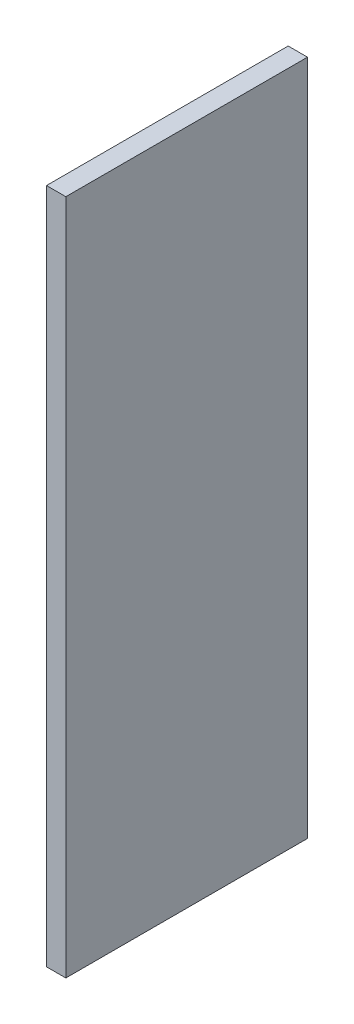
ISO-10303-21;
HEADER;
FILE_DESCRIPTION(('STEP AP214'),'2;1');
FILE_NAME('part.step','',(''),(''),'','','');
FILE_SCHEMA(('AUTOMOTIVE_DESIGN { 1 0 10303 214 1 1 1 1 }'));
ENDSEC;
DATA;
#1=APPLICATION_CONTEXT('core data for automotive mechanical design processes');
#2=APPLICATION_PROTOCOL_DEFINITION('international standard','automotive_design',2000,#1);
#3=PRODUCT_CONTEXT('',#1,'mechanical');
#4=PRODUCT('Part','Part','',(#3));
#5=PRODUCT_RELATED_PRODUCT_CATEGORY('part','',(#4));
#6=PRODUCT_DEFINITION_FORMATION('','',#4);
#7=PRODUCT_DEFINITION_CONTEXT('part definition',#1,'design');
#8=PRODUCT_DEFINITION('design','',#6,#7);
#9=PRODUCT_DEFINITION_SHAPE('','',#8);
#10=(LENGTH_UNIT() NAMED_UNIT(*) SI_UNIT(.MILLI.,.METRE.));
#11=(NAMED_UNIT(*) PLANE_ANGLE_UNIT() SI_UNIT($,.RADIAN.));
#12=(NAMED_UNIT(*) SI_UNIT($,.STERADIAN.) SOLID_ANGLE_UNIT());
#13=UNCERTAINTY_MEASURE_WITH_UNIT(LENGTH_MEASURE(1.E-05),#10,'distance_accuracy_value','');
#14=(GEOMETRIC_REPRESENTATION_CONTEXT(3) GLOBAL_UNCERTAINTY_ASSIGNED_CONTEXT((#13)) GLOBAL_UNIT_ASSIGNED_CONTEXT((#10,
#11,#12)) REPRESENTATION_CONTEXT('',''));
#15=CARTESIAN_POINT('',(0.,0.,0.));
#16=DIRECTION('',(0.,0.,1.));
#17=DIRECTION('',(1.,0.,0.));
#18=AXIS2_PLACEMENT_3D('',#15,#16,#17);
#19=CARTESIAN_POINT('',(0.,0.,5.));
#20=DIRECTION('',(1.,0.,0.));
#21=DIRECTION('',(0.,1.,0.));
#22=AXIS2_PLACEMENT_3D('',#19,#20,#21);
#23=PLANE('',#22);
#24=DIRECTION('',(0.,-1.,0.));
#25=VECTOR('',#24,1.);
#26=CARTESIAN_POINT('',(0.,0.,0.));
#27=LINE('',#26,#25);
#28=CARTESIAN_POINT('',(0.,14.,0.));
#29=VERTEX_POINT('',#28);
#30=CARTESIAN_POINT('',(0.,0.,0.));
#31=VERTEX_POINT('',#30);
#32=EDGE_CURVE('E96',#29,#31,#27,.T.);
#33=ORIENTED_EDGE('',*,*,#32,.T.);
#34=DIRECTION('',(0.,0.,-1.));
#35=VECTOR('',#34,1.);
#36=CARTESIAN_POINT('',(0.,0.,5.));
#37=LINE('',#36,#35);
#38=CARTESIAN_POINT('',(0.,0.,5.));
#39=VERTEX_POINT('',#38);
#40=EDGE_CURVE('E11',#39,#31,#37,.T.);
#41=ORIENTED_EDGE('',*,*,#40,.F.);
#42=DIRECTION('',(0.,-1.,0.));
#43=VECTOR('',#42,1.);
#44=CARTESIAN_POINT('',(0.,0.,5.));
#45=LINE('',#44,#43);
#46=CARTESIAN_POINT('',(0.,14.,5.));
#47=VERTEX_POINT('',#46);
#48=EDGE_CURVE('E84',#47,#39,#45,.T.);
#49=ORIENTED_EDGE('',*,*,#48,.F.);
#50=DIRECTION('',(0.,0.,-1.));
#51=VECTOR('',#50,1.);
#52=CARTESIAN_POINT('',(0.,14.,5.));
#53=LINE('',#52,#51);
#54=EDGE_CURVE('E92',#47,#29,#53,.T.);
#55=ORIENTED_EDGE('',*,*,#54,.T.);
#56=EDGE_LOOP('',(#33,#41,#49,#55));
#57=FACE_BOUND('',#56,.T.);
#58=ADVANCED_FACE('F33',(#57),#23,.F.);
#59=CARTESIAN_POINT('',(0.,0.,5.));
#60=DIRECTION('',(0.,1.,0.));
#61=DIRECTION('',(0.,0.,1.));
#62=AXIS2_PLACEMENT_3D('',#59,#60,#61);
#63=PLANE('',#62);
#64=DIRECTION('',(1.,0.,0.));
#65=VECTOR('',#64,1.);
#66=CARTESIAN_POINT('',(0.,0.,0.));
#67=LINE('',#66,#65);
#68=CARTESIAN_POINT('',(0.4,0.,0.));
#69=VERTEX_POINT('',#68);
#70=EDGE_CURVE('E88',#31,#69,#67,.T.);
#71=ORIENTED_EDGE('',*,*,#70,.T.);
#72=DIRECTION('',(0.,0.,-1.));
#73=VECTOR('',#72,1.);
#74=CARTESIAN_POINT('',(0.4,0.,5.));
#75=LINE('',#74,#73);
#76=CARTESIAN_POINT('',(0.4,0.,5.));
#77=VERTEX_POINT('',#76);
#78=EDGE_CURVE('E41',#77,#69,#75,.T.);
#79=ORIENTED_EDGE('',*,*,#78,.F.);
#80=DIRECTION('',(1.,0.,0.));
#81=VECTOR('',#80,1.);
#82=CARTESIAN_POINT('',(0.,0.,5.));
#83=LINE('',#82,#81);
#84=EDGE_CURVE('E79',#39,#77,#83,.T.);
#85=ORIENTED_EDGE('',*,*,#84,.F.);
#86=ORIENTED_EDGE('',*,*,#40,.T.);
#87=EDGE_LOOP('',(#71,#79,#85,#86));
#88=FACE_BOUND('',#87,.T.);
#89=ADVANCED_FACE('F87',(#88),#63,.F.);
#90=CARTESIAN_POINT('',(0.4,0.,5.));
#91=DIRECTION('',(-1.,0.,0.));
#92=DIRECTION('',(0.,-1.,0.));
#93=AXIS2_PLACEMENT_3D('',#90,#91,#92);
#94=PLANE('',#93);
#95=DIRECTION('',(0.,1.,0.));
#96=VECTOR('',#95,1.);
#97=CARTESIAN_POINT('',(0.4,0.,0.));
#98=LINE('',#97,#96);
#99=CARTESIAN_POINT('',(0.399999999999998,14.,0.));
#100=VERTEX_POINT('',#99);
#101=EDGE_CURVE('E66',#69,#100,#98,.T.);
#102=ORIENTED_EDGE('',*,*,#101,.T.);
#103=DIRECTION('',(0.,0.,-1.));
#104=VECTOR('',#103,1.);
#105=CARTESIAN_POINT('',(0.399999999999998,14.,5.));
#106=LINE('',#105,#104);
#107=CARTESIAN_POINT('',(0.399999999999998,14.,5.));
#108=VERTEX_POINT('',#107);
#109=EDGE_CURVE('E89',#108,#100,#106,.T.);
#110=ORIENTED_EDGE('',*,*,#109,.F.);
#111=DIRECTION('',(0.,1.,0.));
#112=VECTOR('',#111,1.);
#113=CARTESIAN_POINT('',(0.4,0.,5.));
#114=LINE('',#113,#112);
#115=EDGE_CURVE('E82',#77,#108,#114,.T.);
#116=ORIENTED_EDGE('',*,*,#115,.F.);
#117=ORIENTED_EDGE('',*,*,#78,.T.);
#118=EDGE_LOOP('',(#102,#110,#116,#117));
#119=FACE_BOUND('',#118,.T.);
#120=ADVANCED_FACE('F90',(#119),#94,.F.);
#121=CARTESIAN_POINT('',(0.,14.,5.));
#122=DIRECTION('',(0.,-1.,0.));
#123=DIRECTION('',(0.,0.,-1.));
#124=AXIS2_PLACEMENT_3D('',#121,#122,#123);
#125=PLANE('',#124);
#126=DIRECTION('',(-1.,0.,0.));
#127=VECTOR('',#126,1.);
#128=CARTESIAN_POINT('',(0.,14.,0.));
#129=LINE('',#128,#127);
#130=EDGE_CURVE('E72',#100,#29,#129,.T.);
#131=ORIENTED_EDGE('',*,*,#130,.T.);
#132=ORIENTED_EDGE('',*,*,#54,.F.);
#133=DIRECTION('',(-1.,0.,0.));
#134=VECTOR('',#133,1.);
#135=CARTESIAN_POINT('',(0.,14.,5.));
#136=LINE('',#135,#134);
#137=EDGE_CURVE('E49',#108,#47,#136,.T.);
#138=ORIENTED_EDGE('',*,*,#137,.F.);
#139=ORIENTED_EDGE('',*,*,#109,.T.);
#140=EDGE_LOOP('',(#131,#132,#138,#139));
#141=FACE_BOUND('',#140,.T.);
#142=ADVANCED_FACE('F103',(#141),#125,.F.);
#143=CARTESIAN_POINT('',(0.,0.,5.));
#144=DIRECTION('',(0.,0.,-1.));
#145=DIRECTION('',(-1.,0.,0.));
#146=AXIS2_PLACEMENT_3D('',#143,#144,#145);
#147=PLANE('',#146);
#148=ORIENTED_EDGE('',*,*,#48,.T.);
#149=ORIENTED_EDGE('',*,*,#84,.T.);
#150=ORIENTED_EDGE('',*,*,#115,.T.);
#151=ORIENTED_EDGE('',*,*,#137,.T.);
#152=EDGE_LOOP('',(#148,#149,#150,#151));
#153=FACE_BOUND('',#152,.T.);
#154=ADVANCED_FACE('F80',(#153),#147,.F.);
#155=CARTESIAN_POINT('',(0.,0.,0.));
#156=DIRECTION('',(0.,0.,-1.));
#157=DIRECTION('',(-1.,0.,0.));
#158=AXIS2_PLACEMENT_3D('',#155,#156,#157);
#159=PLANE('',#158);
#160=ORIENTED_EDGE('',*,*,#32,.F.);
#161=ORIENTED_EDGE('',*,*,#130,.F.);
#162=ORIENTED_EDGE('',*,*,#101,.F.);
#163=ORIENTED_EDGE('',*,*,#70,.F.);
#164=EDGE_LOOP('',(#160,#161,#162,#163));
#165=FACE_BOUND('',#164,.T.);
#166=ADVANCED_FACE('F106',(#165),#159,.T.);
#167=CLOSED_SHELL('',(#58,#89,#120,#142,#154,#166));
#168=MANIFOLD_SOLID_BREP('B2',#167);
#169=ADVANCED_BREP_SHAPE_REPRESENTATION('',(#18,#168),#14);
#170=SHAPE_DEFINITION_REPRESENTATION(#9,#169);
ENDSEC;
END-ISO-10303-21;
